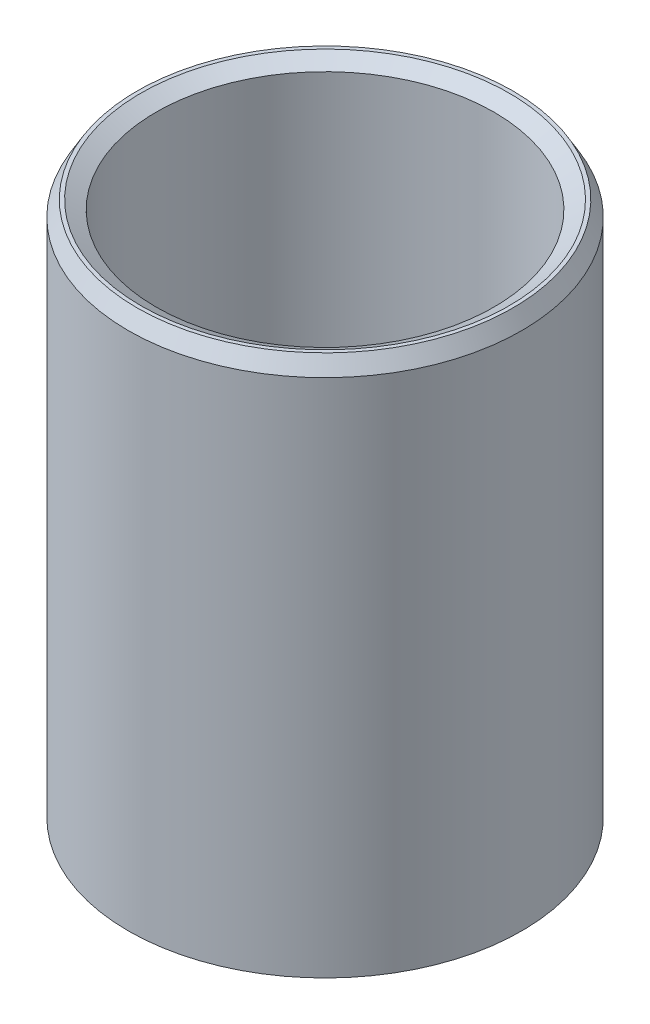
ISO-10303-21;
HEADER;
FILE_DESCRIPTION(('STEP AP214'),'2;1');
FILE_NAME('part.step','',(''),(''),'','','');
FILE_SCHEMA(('AUTOMOTIVE_DESIGN { 1 0 10303 214 1 1 1 1 }'));
ENDSEC;
DATA;
#1=APPLICATION_CONTEXT('core data for automotive mechanical design processes');
#2=APPLICATION_PROTOCOL_DEFINITION('international standard','automotive_design',2000,#1);
#3=PRODUCT_CONTEXT('',#1,'mechanical');
#4=PRODUCT('Part','Part','',(#3));
#5=PRODUCT_RELATED_PRODUCT_CATEGORY('part','',(#4));
#6=PRODUCT_DEFINITION_FORMATION('','',#4);
#7=PRODUCT_DEFINITION_CONTEXT('part definition',#1,'design');
#8=PRODUCT_DEFINITION('design','',#6,#7);
#9=PRODUCT_DEFINITION_SHAPE('','',#8);
#10=(LENGTH_UNIT() NAMED_UNIT(*) SI_UNIT(.MILLI.,.METRE.));
#11=(NAMED_UNIT(*) PLANE_ANGLE_UNIT() SI_UNIT($,.RADIAN.));
#12=(NAMED_UNIT(*) SI_UNIT($,.STERADIAN.) SOLID_ANGLE_UNIT());
#13=UNCERTAINTY_MEASURE_WITH_UNIT(LENGTH_MEASURE(1.E-05),#10,'distance_accuracy_value','');
#14=(GEOMETRIC_REPRESENTATION_CONTEXT(3) GLOBAL_UNCERTAINTY_ASSIGNED_CONTEXT((#13)) GLOBAL_UNIT_ASSIGNED_CONTEXT((#10,
#11,#12)) REPRESENTATION_CONTEXT('',''));
#15=CARTESIAN_POINT('',(0.,0.,0.));
#16=DIRECTION('',(0.,0.,1.));
#17=DIRECTION('',(1.,0.,0.));
#18=AXIS2_PLACEMENT_3D('',#15,#16,#17);
#19=CARTESIAN_POINT('',(0.,131.322968087683,0.));
#20=DIRECTION('',(0.,-1.,0.));
#21=DIRECTION('',(0.,0.,-1.));
#22=AXIS2_PLACEMENT_3D('',#19,#20,#21);
#23=CYLINDRICAL_SURFACE('',#22,47.5);
#24=CARTESIAN_POINT('',(0.,2.12630865332086,0.));
#25=DIRECTION('',(0.,1.,0.));
#26=DIRECTION('',(0.,0.,1.));
#27=AXIS2_PLACEMENT_3D('',#24,#25,#26);
#28=CIRCLE('',#27,47.5);
#29=CARTESIAN_POINT('',(0.,2.12630865332086,47.5));
#30=VERTEX_POINT('',#29);
#31=EDGE_CURVE('E10',#30,#30,#28,.T.);
#32=ORIENTED_EDGE('',*,*,#31,.T.);
#33=EDGE_LOOP('',(#32));
#34=FACE_BOUND('',#33,.T.);
#35=CARTESIAN_POINT('',(0.,127.640093467558,0.));
#36=DIRECTION('',(0.,1.,0.));
#37=DIRECTION('',(0.,0.,1.));
#38=AXIS2_PLACEMENT_3D('',#35,#36,#37);
#39=CIRCLE('',#38,47.5);
#40=CARTESIAN_POINT('',(0.,127.640093467558,47.5));
#41=VERTEX_POINT('',#40);
#42=EDGE_CURVE('E50',#41,#41,#39,.F.);
#43=ORIENTED_EDGE('',*,*,#42,.T.);
#44=EDGE_LOOP('',(#43));
#45=FACE_BOUND('',#44,.T.);
#46=ADVANCED_FACE('F39',(#34,#45),#23,.T.);
#47=CARTESIAN_POINT('',(0.,131.322968087683,0.));
#48=DIRECTION('',(0.,1.,0.));
#49=DIRECTION('',(0.,0.,1.));
#50=AXIS2_PLACEMENT_3D('',#47,#48,#49);
#51=PLANE('',#50);
#52=CARTESIAN_POINT('',(0.,131.322968087683,0.));
#53=DIRECTION('',(0.,1.,0.));
#54=DIRECTION('',(0.,0.,1.));
#55=AXIS2_PLACEMENT_3D('',#52,#53,#54);
#56=CIRCLE('',#55,44.4651066871242);
#57=CARTESIAN_POINT('',(0.,131.322968087683,44.4651066871242));
#58=VERTEX_POINT('',#57);
#59=EDGE_CURVE('E58',#58,#58,#56,.F.);
#60=ORIENTED_EDGE('',*,*,#59,.T.);
#61=EDGE_LOOP('',(#60));
#62=FACE_BOUND('',#61,.T.);
#63=CARTESIAN_POINT('',(0.,131.322968087683,0.));
#64=DIRECTION('',(0.,1.,0.));
#65=DIRECTION('',(0.,0.,1.));
#66=AXIS2_PLACEMENT_3D('',#63,#64,#65);
#67=CIRCLE('',#66,45.3736913466791);
#68=CARTESIAN_POINT('',(0.,131.322968087683,45.3736913466791));
#69=VERTEX_POINT('',#68);
#70=EDGE_CURVE('E61',#69,#69,#67,.T.);
#71=ORIENTED_EDGE('',*,*,#70,.T.);
#72=EDGE_LOOP('',(#71));
#73=FACE_BOUND('',#72,.T.);
#74=ADVANCED_FACE('F88',(#62,#73),#51,.T.);
#75=CARTESIAN_POINT('',(0.,0.,0.));
#76=DIRECTION('',(0.,1.,0.));
#77=DIRECTION('',(0.,0.,1.));
#78=AXIS2_PLACEMENT_3D('',#75,#76,#77);
#79=PLANE('',#78);
#80=CARTESIAN_POINT('',(0.,0.,0.));
#81=DIRECTION('',(0.,1.,0.));
#82=DIRECTION('',(0.,0.,1.));
#83=AXIS2_PLACEMENT_3D('',#80,#81,#82);
#84=CIRCLE('',#83,42.90854072032);
#85=CARTESIAN_POINT('',(0.,0.,42.90854072032));
#86=VERTEX_POINT('',#85);
#87=EDGE_CURVE('E51',#86,#86,#84,.T.);
#88=ORIENTED_EDGE('',*,*,#87,.T.);
#89=EDGE_LOOP('',(#88));
#90=FACE_BOUND('',#89,.T.);
#91=CARTESIAN_POINT('',(0.,0.,0.));
#92=DIRECTION('',(0.,1.,0.));
#93=DIRECTION('',(0.,0.,1.));
#94=AXIS2_PLACEMENT_3D('',#91,#92,#93);
#95=CIRCLE('',#94,43.8171253798749);
#96=CARTESIAN_POINT('',(0.,0.,43.8171253798749));
#97=VERTEX_POINT('',#96);
#98=EDGE_CURVE('E54',#97,#97,#95,.F.);
#99=ORIENTED_EDGE('',*,*,#98,.T.);
#100=EDGE_LOOP('',(#99));
#101=FACE_BOUND('',#100,.T.);
#102=ADVANCED_FACE('F83',(#90,#101),#79,.F.);
#103=CARTESIAN_POINT('',(0.,131.322968087683,0.));
#104=DIRECTION('',(0.,-1.,0.));
#105=DIRECTION('',(0.,0.,-1.));
#106=AXIS2_PLACEMENT_3D('',#103,#104,#105);
#107=CYLINDRICAL_SURFACE('',#106,40.7822320669991);
#108=CARTESIAN_POINT('',(0.,129.196659434362,0.));
#109=DIRECTION('',(0.,1.,0.));
#110=DIRECTION('',(0.,0.,1.));
#111=AXIS2_PLACEMENT_3D('',#108,#109,#110);
#112=CIRCLE('',#111,40.7822320669991);
#113=CARTESIAN_POINT('',(0.,129.196659434362,40.7822320669991));
#114=VERTEX_POINT('',#113);
#115=EDGE_CURVE('E67',#114,#114,#112,.T.);
#116=ORIENTED_EDGE('',*,*,#115,.T.);
#117=EDGE_LOOP('',(#116));
#118=FACE_BOUND('',#117,.T.);
#119=CARTESIAN_POINT('',(0.,3.68287462012518,0.));
#120=DIRECTION('',(0.,1.,0.));
#121=DIRECTION('',(0.,0.,1.));
#122=AXIS2_PLACEMENT_3D('',#119,#120,#121);
#123=CIRCLE('',#122,40.7822320669991);
#124=CARTESIAN_POINT('',(0.,3.68287462012518,40.7822320669991));
#125=VERTEX_POINT('',#124);
#126=EDGE_CURVE('E69',#125,#125,#123,.F.);
#127=ORIENTED_EDGE('',*,*,#126,.T.);
#128=EDGE_LOOP('',(#127));
#129=FACE_BOUND('',#128,.T.);
#130=ADVANCED_FACE('F71',(#118,#129),#107,.F.);
#131=CARTESIAN_POINT('',(0.,129.196659434362,0.));
#132=DIRECTION('',(0.,1.,0.));
#133=DIRECTION('',(0.,0.,1.));
#134=AXIS2_PLACEMENT_3D('',#131,#132,#133);
#135=CONICAL_SURFACE('',#134,40.7822320669991,1.0471975511966);
#136=ORIENTED_EDGE('',*,*,#59,.F.);
#137=EDGE_LOOP('',(#136));
#138=FACE_BOUND('',#137,.T.);
#139=ORIENTED_EDGE('',*,*,#115,.F.);
#140=EDGE_LOOP('',(#139));
#141=FACE_BOUND('',#140,.T.);
#142=ADVANCED_FACE('F77',(#138,#141),#135,.F.);
#143=CARTESIAN_POINT('',(0.,0.,0.));
#144=DIRECTION('',(0.,-1.,0.));
#145=DIRECTION('',(0.,0.,-1.));
#146=AXIS2_PLACEMENT_3D('',#143,#144,#145);
#147=CONICAL_SURFACE('',#146,42.90854072032,0.523598775598293);
#148=ORIENTED_EDGE('',*,*,#126,.F.);
#149=EDGE_LOOP('',(#148));
#150=FACE_BOUND('',#149,.T.);
#151=ORIENTED_EDGE('',*,*,#87,.F.);
#152=EDGE_LOOP('',(#151));
#153=FACE_BOUND('',#152,.T.);
#154=ADVANCED_FACE('F73',(#150,#153),#147,.F.);
#155=CARTESIAN_POINT('',(0.,2.12630865332086,0.));
#156=DIRECTION('',(0.,1.,0.));
#157=DIRECTION('',(0.,0.,1.));
#158=AXIS2_PLACEMENT_3D('',#155,#156,#157);
#159=CONICAL_SURFACE('',#158,47.5,1.0471975511966);
#160=ORIENTED_EDGE('',*,*,#98,.F.);
#161=EDGE_LOOP('',(#160));
#162=FACE_BOUND('',#161,.T.);
#163=ORIENTED_EDGE('',*,*,#31,.F.);
#164=EDGE_LOOP('',(#163));
#165=FACE_BOUND('',#164,.T.);
#166=ADVANCED_FACE('F76',(#162,#165),#159,.T.);
#167=CARTESIAN_POINT('',(0.,131.322968087683,0.));
#168=DIRECTION('',(0.,-1.,0.));
#169=DIRECTION('',(0.,0.,-1.));
#170=AXIS2_PLACEMENT_3D('',#167,#168,#169);
#171=CONICAL_SURFACE('',#170,45.3736913466791,0.523598775598294);
#172=ORIENTED_EDGE('',*,*,#42,.F.);
#173=EDGE_LOOP('',(#172));
#174=FACE_BOUND('',#173,.T.);
#175=ORIENTED_EDGE('',*,*,#70,.F.);
#176=EDGE_LOOP('',(#175));
#177=FACE_BOUND('',#176,.T.);
#178=ADVANCED_FACE('F45',(#174,#177),#171,.T.);
#179=CLOSED_SHELL('',(#46,#74,#102,#130,#142,#154,#166,#178));
#180=MANIFOLD_SOLID_BREP('B2',#179);
#181=ADVANCED_BREP_SHAPE_REPRESENTATION('',(#18,#180),#14);
#182=SHAPE_DEFINITION_REPRESENTATION(#9,#181);
ENDSEC;
END-ISO-10303-21;
